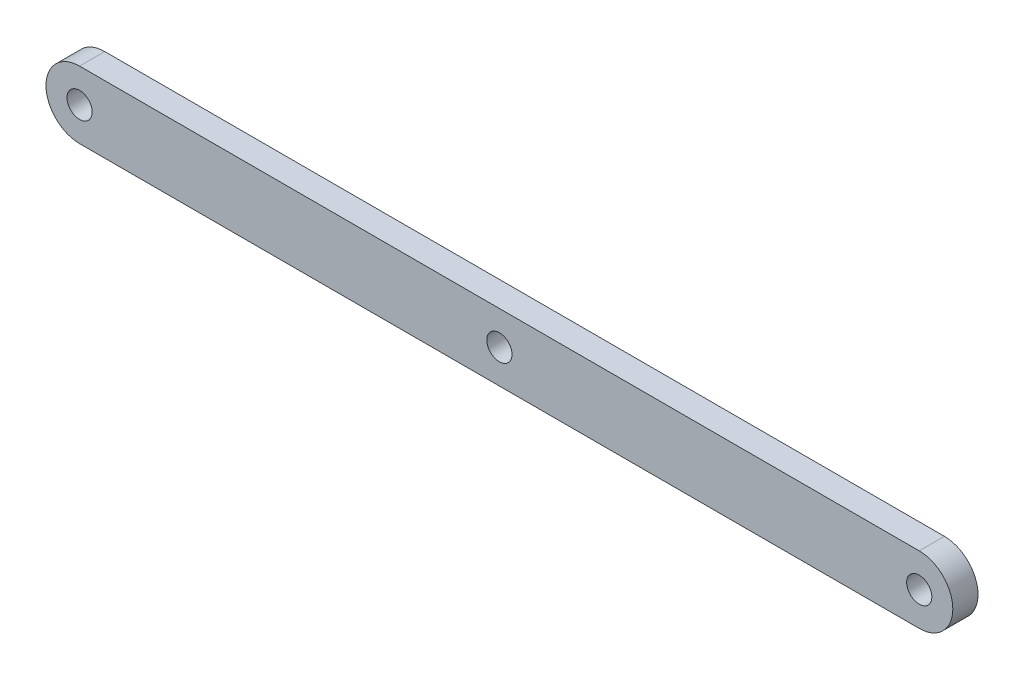
ISO-10303-21;
HEADER;
FILE_DESCRIPTION(('STEP AP214'),'2;1');
FILE_NAME('part.step','',(''),(''),'','','');
FILE_SCHEMA(('AUTOMOTIVE_DESIGN { 1 0 10303 214 1 1 1 1 }'));
ENDSEC;
DATA;
#1=APPLICATION_CONTEXT('core data for automotive mechanical design processes');
#2=APPLICATION_PROTOCOL_DEFINITION('international standard','automotive_design',2000,#1);
#3=PRODUCT_CONTEXT('',#1,'mechanical');
#4=PRODUCT('Part','Part','',(#3));
#5=PRODUCT_RELATED_PRODUCT_CATEGORY('part','',(#4));
#6=PRODUCT_DEFINITION_FORMATION('','',#4);
#7=PRODUCT_DEFINITION_CONTEXT('part definition',#1,'design');
#8=PRODUCT_DEFINITION('design','',#6,#7);
#9=PRODUCT_DEFINITION_SHAPE('','',#8);
#10=(LENGTH_UNIT() NAMED_UNIT(*) SI_UNIT(.MILLI.,.METRE.));
#11=(NAMED_UNIT(*) PLANE_ANGLE_UNIT() SI_UNIT($,.RADIAN.));
#12=(NAMED_UNIT(*) SI_UNIT($,.STERADIAN.) SOLID_ANGLE_UNIT());
#13=UNCERTAINTY_MEASURE_WITH_UNIT(LENGTH_MEASURE(1.E-05),#10,'distance_accuracy_value','');
#14=(GEOMETRIC_REPRESENTATION_CONTEXT(3) GLOBAL_UNCERTAINTY_ASSIGNED_CONTEXT((#13)) GLOBAL_UNIT_ASSIGNED_CONTEXT((#10,
#11,#12)) REPRESENTATION_CONTEXT('',''));
#15=CARTESIAN_POINT('',(0.,0.,0.));
#16=DIRECTION('',(0.,0.,1.));
#17=DIRECTION('',(1.,0.,0.));
#18=AXIS2_PLACEMENT_3D('',#15,#16,#17);
#19=CARTESIAN_POINT('',(50.,0.,3.));
#20=DIRECTION('',(0.,0.,-1.));
#21=DIRECTION('',(-1.,0.,0.));
#22=AXIS2_PLACEMENT_3D('',#19,#20,#21);
#23=CYLINDRICAL_SURFACE('',#22,4.);
#24=CARTESIAN_POINT('',(50.,0.,0.));
#25=DIRECTION('',(0.,0.,1.));
#26=DIRECTION('',(1.,0.,0.));
#27=AXIS2_PLACEMENT_3D('',#24,#25,#26);
#28=CIRCLE('',#27,4.);
#29=CARTESIAN_POINT('',(50.,3.99999999999999,0.));
#30=VERTEX_POINT('',#29);
#31=CARTESIAN_POINT('',(50.,-4.00000000000001,0.));
#32=VERTEX_POINT('',#31);
#33=EDGE_CURVE('E112',#30,#32,#28,.F.);
#34=ORIENTED_EDGE('',*,*,#33,.F.);
#35=DIRECTION('',(0.,0.,-1.));
#36=VECTOR('',#35,1.);
#37=CARTESIAN_POINT('',(50.,3.99999999999999,3.));
#38=LINE('',#37,#36);
#39=CARTESIAN_POINT('',(50.,3.99999999999999,3.));
#40=VERTEX_POINT('',#39);
#41=EDGE_CURVE('E11',#40,#30,#38,.T.);
#42=ORIENTED_EDGE('',*,*,#41,.F.);
#43=CARTESIAN_POINT('',(50.,0.,3.));
#44=DIRECTION('',(0.,0.,1.));
#45=DIRECTION('',(1.,0.,0.));
#46=AXIS2_PLACEMENT_3D('',#43,#44,#45);
#47=CIRCLE('',#46,4.);
#48=CARTESIAN_POINT('',(50.,-4.00000000000001,3.));
#49=VERTEX_POINT('',#48);
#50=EDGE_CURVE('E88',#40,#49,#47,.F.);
#51=ORIENTED_EDGE('',*,*,#50,.T.);
#52=DIRECTION('',(0.,0.,-1.));
#53=VECTOR('',#52,1.);
#54=CARTESIAN_POINT('',(50.,-4.00000000000001,3.));
#55=LINE('',#54,#53);
#56=EDGE_CURVE('E55',#49,#32,#55,.T.);
#57=ORIENTED_EDGE('',*,*,#56,.T.);
#58=EDGE_LOOP('',(#34,#42,#51,#57));
#59=FACE_BOUND('',#58,.T.);
#60=ADVANCED_FACE('F39',(#59),#23,.T.);
#61=CARTESIAN_POINT('',(0.,3.99999999999999,3.));
#62=DIRECTION('',(0.,-1.,0.));
#63=DIRECTION('',(0.,0.,-1.));
#64=AXIS2_PLACEMENT_3D('',#61,#62,#63);
#65=PLANE('',#64);
#66=DIRECTION('',(-1.,0.,0.));
#67=VECTOR('',#66,1.);
#68=CARTESIAN_POINT('',(0.,3.99999999999999,0.));
#69=LINE('',#68,#67);
#70=CARTESIAN_POINT('',(-50.,3.99999999999999,0.));
#71=VERTEX_POINT('',#70);
#72=EDGE_CURVE('E94',#30,#71,#69,.T.);
#73=ORIENTED_EDGE('',*,*,#72,.T.);
#74=DIRECTION('',(0.,0.,-1.));
#75=VECTOR('',#74,1.);
#76=CARTESIAN_POINT('',(-50.,3.99999999999999,3.));
#77=LINE('',#76,#75);
#78=CARTESIAN_POINT('',(-50.,3.99999999999999,3.));
#79=VERTEX_POINT('',#78);
#80=EDGE_CURVE('E47',#79,#71,#77,.T.);
#81=ORIENTED_EDGE('',*,*,#80,.F.);
#82=DIRECTION('',(-1.,0.,0.));
#83=VECTOR('',#82,1.);
#84=CARTESIAN_POINT('',(0.,3.99999999999999,3.));
#85=LINE('',#84,#83);
#86=EDGE_CURVE('E81',#40,#79,#85,.T.);
#87=ORIENTED_EDGE('',*,*,#86,.F.);
#88=ORIENTED_EDGE('',*,*,#41,.T.);
#89=EDGE_LOOP('',(#73,#81,#87,#88));
#90=FACE_BOUND('',#89,.T.);
#91=ADVANCED_FACE('F92',(#90),#65,.F.);
#92=CARTESIAN_POINT('',(-50.,0.,3.));
#93=DIRECTION('',(0.,0.,-1.));
#94=DIRECTION('',(-1.,0.,0.));
#95=AXIS2_PLACEMENT_3D('',#92,#93,#94);
#96=CYLINDRICAL_SURFACE('',#95,4.);
#97=CARTESIAN_POINT('',(-50.,0.,0.));
#98=DIRECTION('',(0.,0.,1.));
#99=DIRECTION('',(1.,0.,0.));
#100=AXIS2_PLACEMENT_3D('',#97,#98,#99);
#101=CIRCLE('',#100,4.);
#102=CARTESIAN_POINT('',(-50.,-4.00000000000001,0.));
#103=VERTEX_POINT('',#102);
#104=EDGE_CURVE('E115',#71,#103,#101,.T.);
#105=ORIENTED_EDGE('',*,*,#104,.T.);
#106=DIRECTION('',(0.,0.,-1.));
#107=VECTOR('',#106,1.);
#108=CARTESIAN_POINT('',(-50.,-4.00000000000001,3.));
#109=LINE('',#108,#107);
#110=CARTESIAN_POINT('',(-50.,-4.00000000000001,3.));
#111=VERTEX_POINT('',#110);
#112=EDGE_CURVE('E69',#111,#103,#109,.T.);
#113=ORIENTED_EDGE('',*,*,#112,.F.);
#114=CARTESIAN_POINT('',(-50.,0.,3.));
#115=DIRECTION('',(0.,0.,1.));
#116=DIRECTION('',(1.,0.,0.));
#117=AXIS2_PLACEMENT_3D('',#114,#115,#116);
#118=CIRCLE('',#117,4.);
#119=EDGE_CURVE('E87',#79,#111,#118,.T.);
#120=ORIENTED_EDGE('',*,*,#119,.F.);
#121=ORIENTED_EDGE('',*,*,#80,.T.);
#122=EDGE_LOOP('',(#105,#113,#120,#121));
#123=FACE_BOUND('',#122,.T.);
#124=ADVANCED_FACE('F97',(#123),#96,.T.);
#125=CARTESIAN_POINT('',(-50.,0.,3.));
#126=DIRECTION('',(0.,0.,-1.));
#127=DIRECTION('',(-1.,0.,0.));
#128=AXIS2_PLACEMENT_3D('',#125,#126,#127);
#129=CYLINDRICAL_SURFACE('',#128,1.5);
#130=CARTESIAN_POINT('',(-50.,0.,3.));
#131=DIRECTION('',(0.,0.,1.));
#132=DIRECTION('',(1.,0.,0.));
#133=AXIS2_PLACEMENT_3D('',#130,#131,#132);
#134=CIRCLE('',#133,1.5);
#135=CARTESIAN_POINT('',(-48.5,0.,3.));
#136=VERTEX_POINT('',#135);
#137=EDGE_CURVE('E106',#136,#136,#134,.T.);
#138=ORIENTED_EDGE('',*,*,#137,.T.);
#139=EDGE_LOOP('',(#138));
#140=FACE_BOUND('',#139,.T.);
#141=CARTESIAN_POINT('',(-50.,0.,0.));
#142=DIRECTION('',(0.,0.,1.));
#143=DIRECTION('',(1.,0.,0.));
#144=AXIS2_PLACEMENT_3D('',#141,#142,#143);
#145=CIRCLE('',#144,1.5);
#146=CARTESIAN_POINT('',(-48.5,0.,0.));
#147=VERTEX_POINT('',#146);
#148=EDGE_CURVE('E123',#147,#147,#145,.T.);
#149=ORIENTED_EDGE('',*,*,#148,.F.);
#150=EDGE_LOOP('',(#149));
#151=FACE_BOUND('',#150,.T.);
#152=ADVANCED_FACE('F143',(#140,#151),#129,.F.);
#153=CARTESIAN_POINT('',(0.,0.,3.));
#154=DIRECTION('',(0.,0.,-1.));
#155=DIRECTION('',(-1.,0.,0.));
#156=AXIS2_PLACEMENT_3D('',#153,#154,#155);
#157=CYLINDRICAL_SURFACE('',#156,1.5);
#158=CARTESIAN_POINT('',(0.,0.,3.));
#159=DIRECTION('',(0.,0.,1.));
#160=DIRECTION('',(1.,0.,0.));
#161=AXIS2_PLACEMENT_3D('',#158,#159,#160);
#162=CIRCLE('',#161,1.5);
#163=CARTESIAN_POINT('',(1.5,0.,3.));
#164=VERTEX_POINT('',#163);
#165=EDGE_CURVE('E100',#164,#164,#162,.T.);
#166=ORIENTED_EDGE('',*,*,#165,.T.);
#167=EDGE_LOOP('',(#166));
#168=FACE_BOUND('',#167,.T.);
#169=CARTESIAN_POINT('',(0.,0.,0.));
#170=DIRECTION('',(0.,0.,1.));
#171=DIRECTION('',(1.,0.,0.));
#172=AXIS2_PLACEMENT_3D('',#169,#170,#171);
#173=CIRCLE('',#172,1.5);
#174=CARTESIAN_POINT('',(1.5,0.,0.));
#175=VERTEX_POINT('',#174);
#176=EDGE_CURVE('E120',#175,#175,#173,.T.);
#177=ORIENTED_EDGE('',*,*,#176,.F.);
#178=EDGE_LOOP('',(#177));
#179=FACE_BOUND('',#178,.T.);
#180=ADVANCED_FACE('F135',(#168,#179),#157,.F.);
#181=CARTESIAN_POINT('',(0.,-4.00000000000001,3.));
#182=DIRECTION('',(0.,-1.,0.));
#183=DIRECTION('',(0.,0.,-1.));
#184=AXIS2_PLACEMENT_3D('',#181,#182,#183);
#185=PLANE('',#184);
#186=DIRECTION('',(-1.,0.,0.));
#187=VECTOR('',#186,1.);
#188=CARTESIAN_POINT('',(0.,-4.00000000000001,0.));
#189=LINE('',#188,#187);
#190=EDGE_CURVE('E117',#32,#103,#189,.T.);
#191=ORIENTED_EDGE('',*,*,#190,.F.);
#192=ORIENTED_EDGE('',*,*,#56,.F.);
#193=DIRECTION('',(-1.,0.,0.));
#194=VECTOR('',#193,1.);
#195=CARTESIAN_POINT('',(0.,-4.00000000000001,3.));
#196=LINE('',#195,#194);
#197=EDGE_CURVE('E98',#49,#111,#196,.T.);
#198=ORIENTED_EDGE('',*,*,#197,.T.);
#199=ORIENTED_EDGE('',*,*,#112,.T.);
#200=EDGE_LOOP('',(#191,#192,#198,#199));
#201=FACE_BOUND('',#200,.T.);
#202=ADVANCED_FACE('F132',(#201),#185,.T.);
#203=CARTESIAN_POINT('',(50.,0.,3.));
#204=DIRECTION('',(0.,0.,-1.));
#205=DIRECTION('',(-1.,0.,0.));
#206=AXIS2_PLACEMENT_3D('',#203,#204,#205);
#207=CYLINDRICAL_SURFACE('',#206,1.5);
#208=CARTESIAN_POINT('',(50.,0.,3.));
#209=DIRECTION('',(0.,0.,1.));
#210=DIRECTION('',(1.,0.,0.));
#211=AXIS2_PLACEMENT_3D('',#208,#209,#210);
#212=CIRCLE('',#211,1.5);
#213=CARTESIAN_POINT('',(51.5,0.,3.));
#214=VERTEX_POINT('',#213);
#215=EDGE_CURVE('E109',#214,#214,#212,.F.);
#216=ORIENTED_EDGE('',*,*,#215,.F.);
#217=EDGE_LOOP('',(#216));
#218=FACE_BOUND('',#217,.T.);
#219=CARTESIAN_POINT('',(50.,0.,0.));
#220=DIRECTION('',(0.,0.,1.));
#221=DIRECTION('',(1.,0.,0.));
#222=AXIS2_PLACEMENT_3D('',#219,#220,#221);
#223=CIRCLE('',#222,1.5);
#224=CARTESIAN_POINT('',(51.5,0.,0.));
#225=VERTEX_POINT('',#224);
#226=EDGE_CURVE('E126',#225,#225,#223,.F.);
#227=ORIENTED_EDGE('',*,*,#226,.T.);
#228=EDGE_LOOP('',(#227));
#229=FACE_BOUND('',#228,.T.);
#230=ADVANCED_FACE('F134',(#218,#229),#207,.F.);
#231=CARTESIAN_POINT('',(0.,0.,3.));
#232=DIRECTION('',(0.,0.,1.));
#233=DIRECTION('',(1.,0.,0.));
#234=AXIS2_PLACEMENT_3D('',#231,#232,#233);
#235=PLANE('',#234);
#236=ORIENTED_EDGE('',*,*,#50,.F.);
#237=ORIENTED_EDGE('',*,*,#86,.T.);
#238=ORIENTED_EDGE('',*,*,#119,.T.);
#239=ORIENTED_EDGE('',*,*,#197,.F.);
#240=EDGE_LOOP('',(#236,#237,#238,#239));
#241=FACE_BOUND('',#240,.T.);
#242=ORIENTED_EDGE('',*,*,#165,.F.);
#243=EDGE_LOOP('',(#242));
#244=FACE_BOUND('',#243,.T.);
#245=ORIENTED_EDGE('',*,*,#137,.F.);
#246=EDGE_LOOP('',(#245));
#247=FACE_BOUND('',#246,.T.);
#248=ORIENTED_EDGE('',*,*,#215,.T.);
#249=EDGE_LOOP('',(#248));
#250=FACE_BOUND('',#249,.T.);
#251=ADVANCED_FACE('F83',(#241,#244,#247,#250),#235,.T.);
#252=CARTESIAN_POINT('',(0.,0.,0.));
#253=DIRECTION('',(0.,0.,1.));
#254=DIRECTION('',(1.,0.,0.));
#255=AXIS2_PLACEMENT_3D('',#252,#253,#254);
#256=PLANE('',#255);
#257=ORIENTED_EDGE('',*,*,#33,.T.);
#258=ORIENTED_EDGE('',*,*,#190,.T.);
#259=ORIENTED_EDGE('',*,*,#104,.F.);
#260=ORIENTED_EDGE('',*,*,#72,.F.);
#261=EDGE_LOOP('',(#257,#258,#259,#260));
#262=FACE_BOUND('',#261,.T.);
#263=ORIENTED_EDGE('',*,*,#176,.T.);
#264=EDGE_LOOP('',(#263));
#265=FACE_BOUND('',#264,.T.);
#266=ORIENTED_EDGE('',*,*,#148,.T.);
#267=EDGE_LOOP('',(#266));
#268=FACE_BOUND('',#267,.T.);
#269=ORIENTED_EDGE('',*,*,#226,.F.);
#270=EDGE_LOOP('',(#269));
#271=FACE_BOUND('',#270,.T.);
#272=ADVANCED_FACE('F163',(#262,#265,#268,#271),#256,.F.);
#273=CLOSED_SHELL('',(#60,#91,#124,#152,#180,#202,#230,#251,#272));
#274=MANIFOLD_SOLID_BREP('B2',#273);
#275=ADVANCED_BREP_SHAPE_REPRESENTATION('',(#18,#274),#14);
#276=SHAPE_DEFINITION_REPRESENTATION(#9,#275);
ENDSEC;
END-ISO-10303-21;
